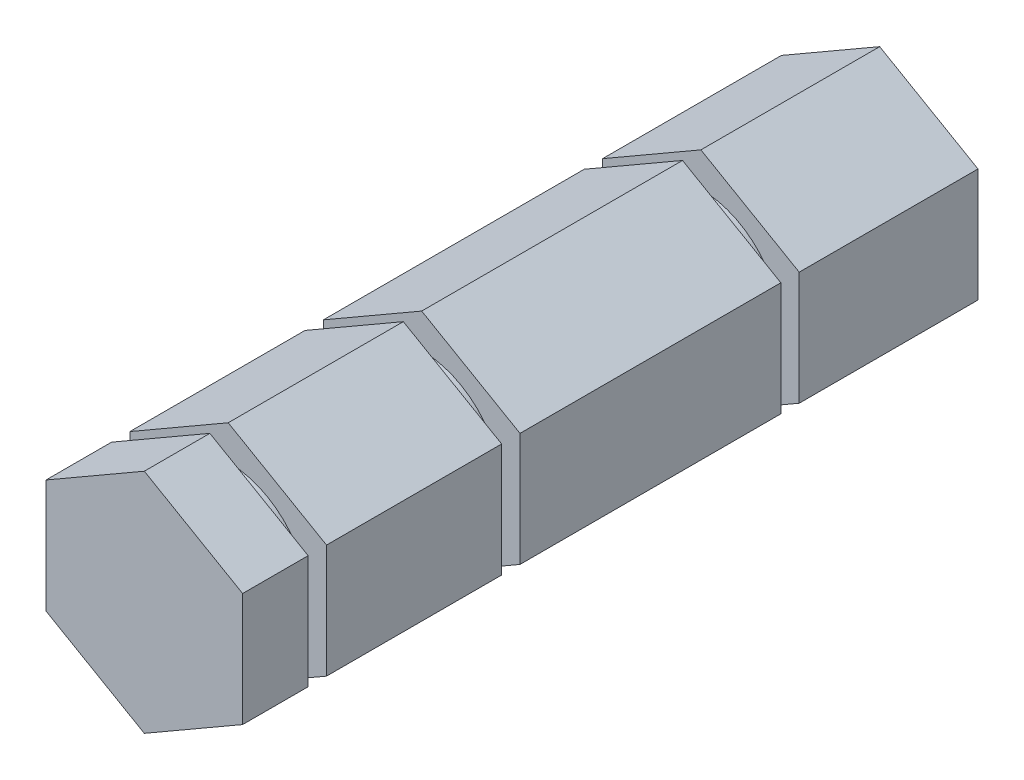
ISO-10303-21;
HEADER;
FILE_DESCRIPTION(('STEP AP214'),'2;1');
FILE_NAME('part.step','',(''),(''),'','','');
FILE_SCHEMA(('AUTOMOTIVE_DESIGN { 1 0 10303 214 1 1 1 1 }'));
ENDSEC;
DATA;
#1=APPLICATION_CONTEXT('core data for automotive mechanical design processes');
#2=APPLICATION_PROTOCOL_DEFINITION('international standard','automotive_design',2000,#1);
#3=PRODUCT_CONTEXT('',#1,'mechanical');
#4=PRODUCT('Part','Part','',(#3));
#5=PRODUCT_RELATED_PRODUCT_CATEGORY('part','',(#4));
#6=PRODUCT_DEFINITION_FORMATION('','',#4);
#7=PRODUCT_DEFINITION_CONTEXT('part definition',#1,'design');
#8=PRODUCT_DEFINITION('design','',#6,#7);
#9=PRODUCT_DEFINITION_SHAPE('','',#8);
#10=(LENGTH_UNIT() NAMED_UNIT(*) SI_UNIT(.MILLI.,.METRE.));
#11=(NAMED_UNIT(*) PLANE_ANGLE_UNIT() SI_UNIT($,.RADIAN.));
#12=(NAMED_UNIT(*) SI_UNIT($,.STERADIAN.) SOLID_ANGLE_UNIT());
#13=UNCERTAINTY_MEASURE_WITH_UNIT(LENGTH_MEASURE(1.E-05),#10,'distance_accuracy_value','');
#14=(GEOMETRIC_REPRESENTATION_CONTEXT(3) GLOBAL_UNCERTAINTY_ASSIGNED_CONTEXT((#13)) GLOBAL_UNIT_ASSIGNED_CONTEXT((#10,
#11,#12)) REPRESENTATION_CONTEXT('',''));
#15=CARTESIAN_POINT('',(0.,0.,0.));
#16=DIRECTION('',(0.,0.,1.));
#17=DIRECTION('',(1.,0.,0.));
#18=AXIS2_PLACEMENT_3D('',#15,#16,#17);
#19=CARTESIAN_POINT('',(4.76249999999996,2.74963065701564,40.6146));
#20=DIRECTION('',(-0.499999999999995,-0.866025403784441,0.));
#21=DIRECTION('',(0.866025403784442,-0.499999999999995,0.));
#22=AXIS2_PLACEMENT_3D('',#19,#20,#21);
#23=PLANE('',#22);
#24=DIRECTION('',(0.,0.,-1.));
#25=VECTOR('',#24,1.);
#26=CARTESIAN_POINT('',(0.,5.49926131403118,40.6146));
#27=LINE('',#26,#25);
#28=CARTESIAN_POINT('',(0.,5.49926131403118,31.5595));
#29=VERTEX_POINT('',#28);
#30=CARTESIAN_POINT('',(0.,5.49926131403118,23.0759));
#31=VERTEX_POINT('',#30);
#32=EDGE_CURVE('E211',#29,#31,#27,.T.);
#33=ORIENTED_EDGE('',*,*,#32,.F.);
#34=DIRECTION('',(0.866025403784442,-0.499999999999995,0.));
#35=VECTOR('',#34,1.);
#36=CARTESIAN_POINT('',(4.76249999999996,2.74963065701564,31.5595));
#37=LINE('',#36,#35);
#38=CARTESIAN_POINT('',(4.76249999999996,2.74963065701564,31.5595));
#39=VERTEX_POINT('',#38);
#40=EDGE_CURVE('E352',#29,#39,#37,.T.);
#41=ORIENTED_EDGE('',*,*,#40,.T.);
#42=DIRECTION('',(0.,0.,-1.));
#43=VECTOR('',#42,1.);
#44=CARTESIAN_POINT('',(4.76249999999996,2.74963065701564,40.6146));
#45=LINE('',#44,#43);
#46=CARTESIAN_POINT('',(4.76249999999996,2.74963065701564,23.0759));
#47=VERTEX_POINT('',#46);
#48=EDGE_CURVE('E248',#39,#47,#45,.T.);
#49=ORIENTED_EDGE('',*,*,#48,.T.);
#50=DIRECTION('',(-0.866025403784442,0.499999999999995,0.));
#51=VECTOR('',#50,1.);
#52=CARTESIAN_POINT('',(4.76249999999996,2.74963065701564,23.0759));
#53=LINE('',#52,#51);
#54=EDGE_CURVE('E261',#47,#31,#53,.T.);
#55=ORIENTED_EDGE('',*,*,#54,.T.);
#56=EDGE_LOOP('',(#33,#41,#49,#55));
#57=FACE_BOUND('',#56,.T.);
#58=ADVANCED_FACE('F34',(#57),#23,.F.);
#59=CARTESIAN_POINT('',(0.,5.49926131403118,40.6146));
#60=DIRECTION('',(0.500000000000001,-0.866025403784438,0.));
#61=DIRECTION('',(0.866025403784438,0.500000000000001,0.));
#62=AXIS2_PLACEMENT_3D('',#59,#60,#61);
#63=PLANE('',#62);
#64=DIRECTION('',(0.,0.,-1.));
#65=VECTOR('',#64,1.);
#66=CARTESIAN_POINT('',(-4.7625,2.74963065701558,40.6146));
#67=LINE('',#66,#65);
#68=CARTESIAN_POINT('',(-4.7625,2.74963065701558,31.5595));
#69=VERTEX_POINT('',#68);
#70=CARTESIAN_POINT('',(-4.7625,2.74963065701558,23.0759));
#71=VERTEX_POINT('',#70);
#72=EDGE_CURVE('E314',#69,#71,#67,.T.);
#73=ORIENTED_EDGE('',*,*,#72,.F.);
#74=DIRECTION('',(0.866025403784438,0.500000000000001,0.));
#75=VECTOR('',#74,1.);
#76=CARTESIAN_POINT('',(0.,5.49926131403118,31.5595));
#77=LINE('',#76,#75);
#78=EDGE_CURVE('E355',#69,#29,#77,.T.);
#79=ORIENTED_EDGE('',*,*,#78,.T.);
#80=ORIENTED_EDGE('',*,*,#32,.T.);
#81=DIRECTION('',(-0.866025403784438,-0.500000000000001,0.));
#82=VECTOR('',#81,1.);
#83=CARTESIAN_POINT('',(0.,5.49926131403118,23.0759));
#84=LINE('',#83,#82);
#85=EDGE_CURVE('E276',#31,#71,#84,.T.);
#86=ORIENTED_EDGE('',*,*,#85,.T.);
#87=EDGE_LOOP('',(#73,#79,#80,#86));
#88=FACE_BOUND('',#87,.T.);
#89=ADVANCED_FACE('F442',(#88),#63,.F.);
#90=CARTESIAN_POINT('',(-4.7625,2.74963065701558,40.6146));
#91=DIRECTION('',(1.,0.,0.));
#92=DIRECTION('',(0.,1.,0.));
#93=AXIS2_PLACEMENT_3D('',#90,#91,#92);
#94=PLANE('',#93);
#95=DIRECTION('',(0.,0.,-1.));
#96=VECTOR('',#95,1.);
#97=CARTESIAN_POINT('',(-4.76249999999998,-2.74963065701561,40.6146));
#98=LINE('',#97,#96);
#99=CARTESIAN_POINT('',(-4.76249999999998,-2.74963065701561,31.5595));
#100=VERTEX_POINT('',#99);
#101=CARTESIAN_POINT('',(-4.76249999999998,-2.74963065701561,23.0759));
#102=VERTEX_POINT('',#101);
#103=EDGE_CURVE('E312',#100,#102,#98,.T.);
#104=ORIENTED_EDGE('',*,*,#103,.F.);
#105=DIRECTION('',(0.,1.,0.));
#106=VECTOR('',#105,1.);
#107=CARTESIAN_POINT('',(-4.7625,2.74963065701558,31.5595));
#108=LINE('',#107,#106);
#109=EDGE_CURVE('E358',#100,#69,#108,.T.);
#110=ORIENTED_EDGE('',*,*,#109,.T.);
#111=ORIENTED_EDGE('',*,*,#72,.T.);
#112=DIRECTION('',(0.,-1.,0.));
#113=VECTOR('',#112,1.);
#114=CARTESIAN_POINT('',(-4.7625,2.74963065701558,23.0759));
#115=LINE('',#114,#113);
#116=EDGE_CURVE('E269',#71,#102,#115,.T.);
#117=ORIENTED_EDGE('',*,*,#116,.T.);
#118=EDGE_LOOP('',(#104,#110,#111,#117));
#119=FACE_BOUND('',#118,.T.);
#120=ADVANCED_FACE('F448',(#119),#94,.F.);
#121=CARTESIAN_POINT('',(-4.76249999999998,-2.74963065701561,40.6146));
#122=DIRECTION('',(0.499999999999995,0.866025403784441,0.));
#123=DIRECTION('',(-0.866025403784442,0.499999999999995,0.));
#124=AXIS2_PLACEMENT_3D('',#121,#122,#123);
#125=PLANE('',#124);
#126=DIRECTION('',(0.,0.,-1.));
#127=VECTOR('',#126,1.);
#128=CARTESIAN_POINT('',(0.,-5.49926131403118,40.6146));
#129=LINE('',#128,#127);
#130=CARTESIAN_POINT('',(0.,-5.49926131403118,31.5595));
#131=VERTEX_POINT('',#130);
#132=CARTESIAN_POINT('',(0.,-5.49926131403118,23.0759));
#133=VERTEX_POINT('',#132);
#134=EDGE_CURVE('E266',#131,#133,#129,.T.);
#135=ORIENTED_EDGE('',*,*,#134,.F.);
#136=DIRECTION('',(-0.866025403784442,0.499999999999995,0.));
#137=VECTOR('',#136,1.);
#138=CARTESIAN_POINT('',(-4.76249999999998,-2.74963065701561,31.5595));
#139=LINE('',#138,#137);
#140=EDGE_CURVE('E361',#131,#100,#139,.T.);
#141=ORIENTED_EDGE('',*,*,#140,.T.);
#142=ORIENTED_EDGE('',*,*,#103,.T.);
#143=DIRECTION('',(0.866025403784442,-0.499999999999995,0.));
#144=VECTOR('',#143,1.);
#145=CARTESIAN_POINT('',(-4.76249999999998,-2.74963065701561,23.0759));
#146=LINE('',#145,#144);
#147=EDGE_CURVE('E267',#102,#133,#146,.T.);
#148=ORIENTED_EDGE('',*,*,#147,.T.);
#149=EDGE_LOOP('',(#135,#141,#142,#148));
#150=FACE_BOUND('',#149,.T.);
#151=ADVANCED_FACE('F519',(#150),#125,.F.);
#152=CARTESIAN_POINT('',(0.,-5.49926131403118,40.6146));
#153=DIRECTION('',(-0.500000000000007,0.866025403784434,0.));
#154=DIRECTION('',(-0.866025403784435,-0.500000000000007,0.));
#155=AXIS2_PLACEMENT_3D('',#152,#153,#154);
#156=PLANE('',#155);
#157=DIRECTION('',(0.,0.,-1.));
#158=VECTOR('',#157,1.);
#159=CARTESIAN_POINT('',(4.76250000000002,-2.74963065701554,40.6146));
#160=LINE('',#159,#158);
#161=CARTESIAN_POINT('',(4.76250000000002,-2.74963065701554,31.5595));
#162=VERTEX_POINT('',#161);
#163=CARTESIAN_POINT('',(4.76250000000002,-2.74963065701554,23.0759));
#164=VERTEX_POINT('',#163);
#165=EDGE_CURVE('E250',#162,#164,#160,.T.);
#166=ORIENTED_EDGE('',*,*,#165,.F.);
#167=DIRECTION('',(-0.866025403784435,-0.500000000000007,0.));
#168=VECTOR('',#167,1.);
#169=CARTESIAN_POINT('',(0.,-5.49926131403118,31.5595));
#170=LINE('',#169,#168);
#171=EDGE_CURVE('E364',#162,#131,#170,.T.);
#172=ORIENTED_EDGE('',*,*,#171,.T.);
#173=ORIENTED_EDGE('',*,*,#134,.T.);
#174=DIRECTION('',(0.866025403784435,0.500000000000007,0.));
#175=VECTOR('',#174,1.);
#176=CARTESIAN_POINT('',(0.,-5.49926131403118,23.0759));
#177=LINE('',#176,#175);
#178=EDGE_CURVE('E257',#133,#164,#177,.T.);
#179=ORIENTED_EDGE('',*,*,#178,.T.);
#180=EDGE_LOOP('',(#166,#172,#173,#179));
#181=FACE_BOUND('',#180,.T.);
#182=ADVANCED_FACE('F263',(#181),#156,.F.);
#183=CARTESIAN_POINT('',(4.76250000000002,-2.74963065701554,40.6146));
#184=DIRECTION('',(-1.,0.,0.));
#185=DIRECTION('',(0.,-1.,0.));
#186=AXIS2_PLACEMENT_3D('',#183,#184,#185);
#187=PLANE('',#186);
#188=ORIENTED_EDGE('',*,*,#48,.F.);
#189=DIRECTION('',(0.,-1.,0.));
#190=VECTOR('',#189,1.);
#191=CARTESIAN_POINT('',(4.76250000000002,-2.74963065701554,31.5595));
#192=LINE('',#191,#190);
#193=EDGE_CURVE('E238',#39,#162,#192,.T.);
#194=ORIENTED_EDGE('',*,*,#193,.T.);
#195=ORIENTED_EDGE('',*,*,#165,.T.);
#196=DIRECTION('',(0.,1.,0.));
#197=VECTOR('',#196,1.);
#198=CARTESIAN_POINT('',(4.76250000000002,-2.74963065701554,23.0759));
#199=LINE('',#198,#197);
#200=EDGE_CURVE('E215',#164,#47,#199,.T.);
#201=ORIENTED_EDGE('',*,*,#200,.T.);
#202=EDGE_LOOP('',(#188,#194,#195,#201));
#203=FACE_BOUND('',#202,.T.);
#204=ADVANCED_FACE('F247',(#203),#187,.F.);
#205=CARTESIAN_POINT('',(0.,0.,23.0759));
#206=DIRECTION('',(0.,0.,1.));
#207=DIRECTION('',(1.,0.,0.));
#208=AXIS2_PLACEMENT_3D('',#205,#206,#207);
#209=PLANE('',#208);
#210=CARTESIAN_POINT('',(0.,0.,23.0759));
#211=DIRECTION('',(0.,0.,-1.));
#212=DIRECTION('',(-1.,0.,0.));
#213=AXIS2_PLACEMENT_3D('',#210,#211,#212);
#214=CIRCLE('',#213,3.8481);
#215=CARTESIAN_POINT('',(-3.8481,0.,23.0759));
#216=VERTEX_POINT('',#215);
#217=EDGE_CURVE('E335',#216,#216,#214,.T.);
#218=ORIENTED_EDGE('',*,*,#217,.F.);
#219=EDGE_LOOP('',(#218));
#220=FACE_BOUND('',#219,.T.);
#221=ORIENTED_EDGE('',*,*,#200,.F.);
#222=ORIENTED_EDGE('',*,*,#178,.F.);
#223=ORIENTED_EDGE('',*,*,#147,.F.);
#224=ORIENTED_EDGE('',*,*,#116,.F.);
#225=ORIENTED_EDGE('',*,*,#85,.F.);
#226=ORIENTED_EDGE('',*,*,#54,.F.);
#227=EDGE_LOOP('',(#221,#222,#223,#224,#225,#226));
#228=FACE_BOUND('',#227,.T.);
#229=ADVANCED_FACE('F255',(#220,#228),#209,.F.);
#230=CARTESIAN_POINT('',(0.,0.,22.1869));
#231=DIRECTION('',(0.,0.,1.));
#232=DIRECTION('',(1.,0.,0.));
#233=AXIS2_PLACEMENT_3D('',#230,#231,#232);
#234=PLANE('',#233);
#235=CARTESIAN_POINT('',(0.,0.,22.1869));
#236=DIRECTION('',(0.,0.,-1.));
#237=DIRECTION('',(-1.,0.,0.));
#238=AXIS2_PLACEMENT_3D('',#235,#236,#237);
#239=CIRCLE('',#238,3.8481);
#240=CARTESIAN_POINT('',(-3.8481,0.,22.1869));
#241=VERTEX_POINT('',#240);
#242=EDGE_CURVE('E336',#241,#241,#239,.T.);
#243=ORIENTED_EDGE('',*,*,#242,.T.);
#244=EDGE_LOOP('',(#243));
#245=FACE_BOUND('',#244,.T.);
#246=DIRECTION('',(-0.866025403784442,0.499999999999995,0.));
#247=VECTOR('',#246,1.);
#248=CARTESIAN_POINT('',(4.76249999999996,2.74963065701564,22.1869));
#249=LINE('',#248,#247);
#250=CARTESIAN_POINT('',(4.76249999999996,2.74963065701564,22.1869));
#251=VERTEX_POINT('',#250);
#252=CARTESIAN_POINT('',(0.,5.49926131403118,22.1869));
#253=VERTEX_POINT('',#252);
#254=EDGE_CURVE('E230',#251,#253,#249,.T.);
#255=ORIENTED_EDGE('',*,*,#254,.T.);
#256=DIRECTION('',(-0.866025403784438,-0.500000000000001,0.));
#257=VECTOR('',#256,1.);
#258=CARTESIAN_POINT('',(0.,5.49926131403118,22.1869));
#259=LINE('',#258,#257);
#260=CARTESIAN_POINT('',(-4.7625,2.74963065701558,22.1869));
#261=VERTEX_POINT('',#260);
#262=EDGE_CURVE('E225',#253,#261,#259,.T.);
#263=ORIENTED_EDGE('',*,*,#262,.T.);
#264=DIRECTION('',(0.,-1.,0.));
#265=VECTOR('',#264,1.);
#266=CARTESIAN_POINT('',(-4.7625,2.74963065701558,22.1869));
#267=LINE('',#266,#265);
#268=CARTESIAN_POINT('',(-4.76249999999998,-2.74963065701561,22.1869));
#269=VERTEX_POINT('',#268);
#270=EDGE_CURVE('E326',#261,#269,#267,.T.);
#271=ORIENTED_EDGE('',*,*,#270,.T.);
#272=DIRECTION('',(0.866025403784442,-0.499999999999995,0.));
#273=VECTOR('',#272,1.);
#274=CARTESIAN_POINT('',(-4.76249999999998,-2.74963065701561,22.1869));
#275=LINE('',#274,#273);
#276=CARTESIAN_POINT('',(0.,-5.49926131403118,22.1869));
#277=VERTEX_POINT('',#276);
#278=EDGE_CURVE('E329',#269,#277,#275,.T.);
#279=ORIENTED_EDGE('',*,*,#278,.T.);
#280=DIRECTION('',(0.866025403784435,0.500000000000007,0.));
#281=VECTOR('',#280,1.);
#282=CARTESIAN_POINT('',(0.,-5.49926131403118,22.1869));
#283=LINE('',#282,#281);
#284=CARTESIAN_POINT('',(4.76250000000002,-2.74963065701554,22.1869));
#285=VERTEX_POINT('',#284);
#286=EDGE_CURVE('E331',#277,#285,#283,.T.);
#287=ORIENTED_EDGE('',*,*,#286,.T.);
#288=DIRECTION('',(0.,1.,0.));
#289=VECTOR('',#288,1.);
#290=CARTESIAN_POINT('',(4.76250000000002,-2.74963065701554,22.1869));
#291=LINE('',#290,#289);
#292=EDGE_CURVE('E210',#285,#251,#291,.T.);
#293=ORIENTED_EDGE('',*,*,#292,.T.);
#294=EDGE_LOOP('',(#255,#263,#271,#279,#287,#293));
#295=FACE_BOUND('',#294,.T.);
#296=ADVANCED_FACE('F590',(#245,#295),#234,.T.);
#297=CARTESIAN_POINT('',(0.,0.,23.0759));
#298=DIRECTION('',(0.,0.,-1.));
#299=DIRECTION('',(-1.,0.,0.));
#300=AXIS2_PLACEMENT_3D('',#297,#298,#299);
#301=CYLINDRICAL_SURFACE('',#300,3.8481);
#302=ORIENTED_EDGE('',*,*,#217,.T.);
#303=EDGE_LOOP('',(#302));
#304=FACE_BOUND('',#303,.T.);
#305=ORIENTED_EDGE('',*,*,#242,.F.);
#306=EDGE_LOOP('',(#305));
#307=FACE_BOUND('',#306,.T.);
#308=ADVANCED_FACE('F437',(#304,#307),#301,.T.);
#309=CARTESIAN_POINT('',(4.76250000000002,-2.74963065701554,9.5504));
#310=VERTEX_POINT('',#309);
#311=EDGE_CURVE('E305',#285,#310,#160,.T.);
#312=ORIENTED_EDGE('',*,*,#311,.T.);
#313=DIRECTION('',(0.,1.,0.));
#314=VECTOR('',#313,1.);
#315=CARTESIAN_POINT('',(4.76250000000002,-2.74963065701554,9.5504));
#316=LINE('',#315,#314);
#317=CARTESIAN_POINT('',(4.76249999999996,2.74963065701564,9.5504));
#318=VERTEX_POINT('',#317);
#319=EDGE_CURVE('E382',#310,#318,#316,.T.);
#320=ORIENTED_EDGE('',*,*,#319,.T.);
#321=EDGE_CURVE('E233',#251,#318,#45,.T.);
#322=ORIENTED_EDGE('',*,*,#321,.F.);
#323=ORIENTED_EDGE('',*,*,#292,.F.);
#324=EDGE_LOOP('',(#312,#320,#322,#323));
#325=FACE_BOUND('',#324,.T.);
#326=ADVANCED_FACE('F423',(#325),#187,.F.);
#327=CARTESIAN_POINT('',(0.,-5.49926131403118,9.5504));
#328=VERTEX_POINT('',#327);
#329=EDGE_CURVE('E309',#277,#328,#129,.T.);
#330=ORIENTED_EDGE('',*,*,#329,.T.);
#331=DIRECTION('',(0.866025403784435,0.500000000000007,0.));
#332=VECTOR('',#331,1.);
#333=CARTESIAN_POINT('',(0.,-5.49926131403118,9.5504));
#334=LINE('',#333,#332);
#335=EDGE_CURVE('E384',#328,#310,#334,.T.);
#336=ORIENTED_EDGE('',*,*,#335,.T.);
#337=ORIENTED_EDGE('',*,*,#311,.F.);
#338=ORIENTED_EDGE('',*,*,#286,.F.);
#339=EDGE_LOOP('',(#330,#336,#337,#338));
#340=FACE_BOUND('',#339,.T.);
#341=ADVANCED_FACE('F430',(#340),#156,.F.);
#342=CARTESIAN_POINT('',(-4.76249999999998,-2.74963065701561,9.5504));
#343=VERTEX_POINT('',#342);
#344=EDGE_CURVE('E313',#269,#343,#98,.T.);
#345=ORIENTED_EDGE('',*,*,#344,.T.);
#346=DIRECTION('',(0.866025403784442,-0.499999999999995,0.));
#347=VECTOR('',#346,1.);
#348=CARTESIAN_POINT('',(-4.76249999999998,-2.74963065701561,9.5504));
#349=LINE('',#348,#347);
#350=EDGE_CURVE('E387',#343,#328,#349,.T.);
#351=ORIENTED_EDGE('',*,*,#350,.T.);
#352=ORIENTED_EDGE('',*,*,#329,.F.);
#353=ORIENTED_EDGE('',*,*,#278,.F.);
#354=EDGE_LOOP('',(#345,#351,#352,#353));
#355=FACE_BOUND('',#354,.T.);
#356=ADVANCED_FACE('F510',(#355),#125,.F.);
#357=CARTESIAN_POINT('',(-4.7625,2.74963065701558,9.5504));
#358=VERTEX_POINT('',#357);
#359=EDGE_CURVE('E315',#261,#358,#67,.T.);
#360=ORIENTED_EDGE('',*,*,#359,.T.);
#361=DIRECTION('',(0.,-1.,0.));
#362=VECTOR('',#361,1.);
#363=CARTESIAN_POINT('',(-4.7625,2.74963065701558,9.5504));
#364=LINE('',#363,#362);
#365=EDGE_CURVE('E324',#358,#343,#364,.T.);
#366=ORIENTED_EDGE('',*,*,#365,.T.);
#367=ORIENTED_EDGE('',*,*,#344,.F.);
#368=ORIENTED_EDGE('',*,*,#270,.F.);
#369=EDGE_LOOP('',(#360,#366,#367,#368));
#370=FACE_BOUND('',#369,.T.);
#371=ADVANCED_FACE('F322',(#370),#94,.F.);
#372=CARTESIAN_POINT('',(0.,5.49926131403118,9.5504));
#373=VERTEX_POINT('',#372);
#374=EDGE_CURVE('E214',#253,#373,#27,.T.);
#375=ORIENTED_EDGE('',*,*,#374,.T.);
#376=DIRECTION('',(-0.866025403784438,-0.500000000000001,0.));
#377=VECTOR('',#376,1.);
#378=CARTESIAN_POINT('',(0.,5.49926131403118,9.5504));
#379=LINE('',#378,#377);
#380=EDGE_CURVE('E55',#373,#358,#379,.T.);
#381=ORIENTED_EDGE('',*,*,#380,.T.);
#382=ORIENTED_EDGE('',*,*,#359,.F.);
#383=ORIENTED_EDGE('',*,*,#262,.F.);
#384=EDGE_LOOP('',(#375,#381,#382,#383));
#385=FACE_BOUND('',#384,.T.);
#386=ADVANCED_FACE('F222',(#385),#63,.F.);
#387=ORIENTED_EDGE('',*,*,#321,.T.);
#388=DIRECTION('',(-0.866025403784442,0.499999999999995,0.));
#389=VECTOR('',#388,1.);
#390=CARTESIAN_POINT('',(4.76249999999996,2.74963065701564,9.5504));
#391=LINE('',#390,#389);
#392=EDGE_CURVE('E232',#318,#373,#391,.T.);
#393=ORIENTED_EDGE('',*,*,#392,.T.);
#394=ORIENTED_EDGE('',*,*,#374,.F.);
#395=ORIENTED_EDGE('',*,*,#254,.F.);
#396=EDGE_LOOP('',(#387,#393,#394,#395));
#397=FACE_BOUND('',#396,.T.);
#398=ADVANCED_FACE('F229',(#397),#23,.F.);
#399=CARTESIAN_POINT('',(0.,0.,32.4485));
#400=DIRECTION('',(0.,0.,-1.));
#401=DIRECTION('',(-1.,0.,0.));
#402=AXIS2_PLACEMENT_3D('',#399,#400,#401);
#403=PLANE('',#402);
#404=CARTESIAN_POINT('',(0.,0.,32.4485));
#405=DIRECTION('',(0.,0.,-1.));
#406=DIRECTION('',(-1.,0.,0.));
#407=AXIS2_PLACEMENT_3D('',#404,#405,#406);
#408=CIRCLE('',#407,3.8481);
#409=CARTESIAN_POINT('',(-3.8481,0.,32.4485));
#410=VERTEX_POINT('',#409);
#411=EDGE_CURVE('E366',#410,#410,#408,.T.);
#412=ORIENTED_EDGE('',*,*,#411,.F.);
#413=EDGE_LOOP('',(#412));
#414=FACE_BOUND('',#413,.T.);
#415=DIRECTION('',(0.866025403784442,-0.499999999999995,0.));
#416=VECTOR('',#415,1.);
#417=CARTESIAN_POINT('',(4.76249999999996,2.74963065701564,32.4485));
#418=LINE('',#417,#416);
#419=CARTESIAN_POINT('',(0.,5.49926131403118,32.4485));
#420=VERTEX_POINT('',#419);
#421=CARTESIAN_POINT('',(4.76249999999996,2.74963065701564,32.4485));
#422=VERTEX_POINT('',#421);
#423=EDGE_CURVE('E209',#420,#422,#418,.T.);
#424=ORIENTED_EDGE('',*,*,#423,.T.);
#425=DIRECTION('',(0.,-1.,0.));
#426=VECTOR('',#425,1.);
#427=CARTESIAN_POINT('',(4.76250000000002,-2.74963065701554,32.4485));
#428=LINE('',#427,#426);
#429=CARTESIAN_POINT('',(4.76250000000002,-2.74963065701554,32.4485));
#430=VERTEX_POINT('',#429);
#431=EDGE_CURVE('E235',#422,#430,#428,.T.);
#432=ORIENTED_EDGE('',*,*,#431,.T.);
#433=DIRECTION('',(-0.866025403784435,-0.500000000000007,0.));
#434=VECTOR('',#433,1.);
#435=CARTESIAN_POINT('',(0.,-5.49926131403118,32.4485));
#436=LINE('',#435,#434);
#437=CARTESIAN_POINT('',(0.,-5.49926131403118,32.4485));
#438=VERTEX_POINT('',#437);
#439=EDGE_CURVE('E349',#430,#438,#436,.T.);
#440=ORIENTED_EDGE('',*,*,#439,.T.);
#441=DIRECTION('',(-0.866025403784442,0.499999999999995,0.));
#442=VECTOR('',#441,1.);
#443=CARTESIAN_POINT('',(-4.76249999999998,-2.74963065701561,32.4485));
#444=LINE('',#443,#442);
#445=CARTESIAN_POINT('',(-4.76249999999998,-2.74963065701561,32.4485));
#446=VERTEX_POINT('',#445);
#447=EDGE_CURVE('E346',#438,#446,#444,.T.);
#448=ORIENTED_EDGE('',*,*,#447,.T.);
#449=DIRECTION('',(0.,1.,0.));
#450=VECTOR('',#449,1.);
#451=CARTESIAN_POINT('',(-4.7625,2.74963065701558,32.4485));
#452=LINE('',#451,#450);
#453=CARTESIAN_POINT('',(-4.7625,2.74963065701558,32.4485));
#454=VERTEX_POINT('',#453);
#455=EDGE_CURVE('E344',#446,#454,#452,.T.);
#456=ORIENTED_EDGE('',*,*,#455,.T.);
#457=DIRECTION('',(0.866025403784438,0.500000000000001,0.));
#458=VECTOR('',#457,1.);
#459=CARTESIAN_POINT('',(0.,5.49926131403118,32.4485));
#460=LINE('',#459,#458);
#461=EDGE_CURVE('E342',#454,#420,#460,.T.);
#462=ORIENTED_EDGE('',*,*,#461,.T.);
#463=EDGE_LOOP('',(#424,#432,#440,#448,#456,#462));
#464=FACE_BOUND('',#463,.T.);
#465=ADVANCED_FACE('F416',(#414,#464),#403,.T.);
#466=CARTESIAN_POINT('',(0.,0.,31.5595));
#467=DIRECTION('',(0.,0.,-1.));
#468=DIRECTION('',(-1.,0.,0.));
#469=AXIS2_PLACEMENT_3D('',#466,#467,#468);
#470=PLANE('',#469);
#471=CARTESIAN_POINT('',(0.,0.,31.5595));
#472=DIRECTION('',(0.,0.,-1.));
#473=DIRECTION('',(-1.,0.,0.));
#474=AXIS2_PLACEMENT_3D('',#471,#472,#473);
#475=CIRCLE('',#474,3.8481);
#476=CARTESIAN_POINT('',(-3.8481,0.,31.5595));
#477=VERTEX_POINT('',#476);
#478=EDGE_CURVE('E367',#477,#477,#475,.T.);
#479=ORIENTED_EDGE('',*,*,#478,.T.);
#480=EDGE_LOOP('',(#479));
#481=FACE_BOUND('',#480,.T.);
#482=ORIENTED_EDGE('',*,*,#78,.F.);
#483=ORIENTED_EDGE('',*,*,#109,.F.);
#484=ORIENTED_EDGE('',*,*,#140,.F.);
#485=ORIENTED_EDGE('',*,*,#171,.F.);
#486=ORIENTED_EDGE('',*,*,#193,.F.);
#487=ORIENTED_EDGE('',*,*,#40,.F.);
#488=EDGE_LOOP('',(#482,#483,#484,#485,#486,#487));
#489=FACE_BOUND('',#488,.T.);
#490=ADVANCED_FACE('F432',(#481,#489),#470,.F.);
#491=CARTESIAN_POINT('',(0.,0.,32.4485));
#492=DIRECTION('',(0.,0.,-1.));
#493=DIRECTION('',(-1.,0.,0.));
#494=AXIS2_PLACEMENT_3D('',#491,#492,#493);
#495=CYLINDRICAL_SURFACE('',#494,3.8481);
#496=ORIENTED_EDGE('',*,*,#411,.T.);
#497=EDGE_LOOP('',(#496));
#498=FACE_BOUND('',#497,.T.);
#499=ORIENTED_EDGE('',*,*,#478,.F.);
#500=EDGE_LOOP('',(#499));
#501=FACE_BOUND('',#500,.T.);
#502=ADVANCED_FACE('F421',(#498,#501),#495,.T.);
#503=CARTESIAN_POINT('',(4.76249999999996,2.74963065701564,35.6235));
#504=VERTEX_POINT('',#503);
#505=EDGE_CURVE('E299',#504,#422,#45,.T.);
#506=ORIENTED_EDGE('',*,*,#505,.F.);
#507=DIRECTION('',(0.,-1.,0.));
#508=VECTOR('',#507,1.);
#509=CARTESIAN_POINT('',(4.76250000000002,-2.74963065701554,35.6235));
#510=LINE('',#509,#508);
#511=CARTESIAN_POINT('',(4.76250000000002,-2.74963065701554,35.6235));
#512=VERTEX_POINT('',#511);
#513=EDGE_CURVE('E48',#504,#512,#510,.T.);
#514=ORIENTED_EDGE('',*,*,#513,.T.);
#515=EDGE_CURVE('E302',#512,#430,#160,.T.);
#516=ORIENTED_EDGE('',*,*,#515,.T.);
#517=ORIENTED_EDGE('',*,*,#431,.F.);
#518=EDGE_LOOP('',(#506,#514,#516,#517));
#519=FACE_BOUND('',#518,.T.);
#520=ADVANCED_FACE('F419',(#519),#187,.F.);
#521=ORIENTED_EDGE('',*,*,#515,.F.);
#522=DIRECTION('',(-0.866025403784435,-0.500000000000007,0.));
#523=VECTOR('',#522,1.);
#524=CARTESIAN_POINT('',(0.,-5.49926131403118,35.6235));
#525=LINE('',#524,#523);
#526=CARTESIAN_POINT('',(0.,-5.49926131403118,35.6235));
#527=VERTEX_POINT('',#526);
#528=EDGE_CURVE('E399',#512,#527,#525,.T.);
#529=ORIENTED_EDGE('',*,*,#528,.T.);
#530=EDGE_CURVE('E306',#527,#438,#129,.T.);
#531=ORIENTED_EDGE('',*,*,#530,.T.);
#532=ORIENTED_EDGE('',*,*,#439,.F.);
#533=EDGE_LOOP('',(#521,#529,#531,#532));
#534=FACE_BOUND('',#533,.T.);
#535=ADVANCED_FACE('F414',(#534),#156,.F.);
#536=ORIENTED_EDGE('',*,*,#530,.F.);
#537=DIRECTION('',(-0.866025403784442,0.499999999999995,0.));
#538=VECTOR('',#537,1.);
#539=CARTESIAN_POINT('',(-4.76249999999998,-2.74963065701561,35.6235));
#540=LINE('',#539,#538);
#541=CARTESIAN_POINT('',(-4.76249999999998,-2.74963065701561,35.6235));
#542=VERTEX_POINT('',#541);
#543=EDGE_CURVE('E402',#527,#542,#540,.T.);
#544=ORIENTED_EDGE('',*,*,#543,.T.);
#545=EDGE_CURVE('E310',#542,#446,#98,.T.);
#546=ORIENTED_EDGE('',*,*,#545,.T.);
#547=ORIENTED_EDGE('',*,*,#447,.F.);
#548=EDGE_LOOP('',(#536,#544,#546,#547));
#549=FACE_BOUND('',#548,.T.);
#550=ADVANCED_FACE('F409',(#549),#125,.F.);
#551=ORIENTED_EDGE('',*,*,#545,.F.);
#552=DIRECTION('',(0.,1.,0.));
#553=VECTOR('',#552,1.);
#554=CARTESIAN_POINT('',(-4.7625,2.74963065701558,35.6235));
#555=LINE('',#554,#553);
#556=CARTESIAN_POINT('',(-4.7625,2.74963065701558,35.6235));
#557=VERTEX_POINT('',#556);
#558=EDGE_CURVE('E204',#542,#557,#555,.T.);
#559=ORIENTED_EDGE('',*,*,#558,.T.);
#560=EDGE_CURVE('E203',#557,#454,#67,.T.);
#561=ORIENTED_EDGE('',*,*,#560,.T.);
#562=ORIENTED_EDGE('',*,*,#455,.F.);
#563=EDGE_LOOP('',(#551,#559,#561,#562));
#564=FACE_BOUND('',#563,.T.);
#565=ADVANCED_FACE('F406',(#564),#94,.F.);
#566=ORIENTED_EDGE('',*,*,#560,.F.);
#567=DIRECTION('',(0.866025403784438,0.500000000000001,0.));
#568=VECTOR('',#567,1.);
#569=CARTESIAN_POINT('',(0.,5.49926131403118,35.6235));
#570=LINE('',#569,#568);
#571=CARTESIAN_POINT('',(0.,5.49926131403118,35.6235));
#572=VERTEX_POINT('',#571);
#573=EDGE_CURVE('E192',#557,#572,#570,.T.);
#574=ORIENTED_EDGE('',*,*,#573,.T.);
#575=EDGE_CURVE('E201',#572,#420,#27,.T.);
#576=ORIENTED_EDGE('',*,*,#575,.T.);
#577=ORIENTED_EDGE('',*,*,#461,.F.);
#578=EDGE_LOOP('',(#566,#574,#576,#577));
#579=FACE_BOUND('',#578,.T.);
#580=ADVANCED_FACE('F199',(#579),#63,.F.);
#581=ORIENTED_EDGE('',*,*,#575,.F.);
#582=DIRECTION('',(0.866025403784442,-0.499999999999995,0.));
#583=VECTOR('',#582,1.);
#584=CARTESIAN_POINT('',(4.76249999999996,2.74963065701564,35.6235));
#585=LINE('',#584,#583);
#586=EDGE_CURVE('E12',#572,#504,#585,.T.);
#587=ORIENTED_EDGE('',*,*,#586,.T.);
#588=ORIENTED_EDGE('',*,*,#505,.T.);
#589=ORIENTED_EDGE('',*,*,#423,.F.);
#590=EDGE_LOOP('',(#581,#587,#588,#589));
#591=FACE_BOUND('',#590,.T.);
#592=ADVANCED_FACE('F207',(#591),#23,.F.);
#593=CARTESIAN_POINT('',(0.,0.,8.6614));
#594=DIRECTION('',(0.,0.,1.));
#595=DIRECTION('',(1.,0.,0.));
#596=AXIS2_PLACEMENT_3D('',#593,#594,#595);
#597=PLANE('',#596);
#598=CARTESIAN_POINT('',(0.,0.,8.6614));
#599=DIRECTION('',(0.,0.,1.));
#600=DIRECTION('',(1.,0.,0.));
#601=AXIS2_PLACEMENT_3D('',#598,#599,#600);
#602=CIRCLE('',#601,3.8481);
#603=CARTESIAN_POINT('',(3.8481,0.,8.6614));
#604=VERTEX_POINT('',#603);
#605=EDGE_CURVE('E392',#604,#604,#602,.T.);
#606=ORIENTED_EDGE('',*,*,#605,.F.);
#607=EDGE_LOOP('',(#606));
#608=FACE_BOUND('',#607,.T.);
#609=DIRECTION('',(0.,1.,0.));
#610=VECTOR('',#609,1.);
#611=CARTESIAN_POINT('',(4.76250000000002,-2.74963065701554,8.6614));
#612=LINE('',#611,#610);
#613=CARTESIAN_POINT('',(4.76250000000002,-2.74963065701554,8.6614));
#614=VERTEX_POINT('',#613);
#615=CARTESIAN_POINT('',(4.76249999999996,2.74963065701564,8.6614));
#616=VERTEX_POINT('',#615);
#617=EDGE_CURVE('E370',#614,#616,#612,.T.);
#618=ORIENTED_EDGE('',*,*,#617,.T.);
#619=DIRECTION('',(-0.866025403784442,0.499999999999995,0.));
#620=VECTOR('',#619,1.);
#621=CARTESIAN_POINT('',(4.76249999999996,2.74963065701564,8.6614));
#622=LINE('',#621,#620);
#623=CARTESIAN_POINT('',(0.,5.49926131403118,8.6614));
#624=VERTEX_POINT('',#623);
#625=EDGE_CURVE('E41',#616,#624,#622,.T.);
#626=ORIENTED_EDGE('',*,*,#625,.T.);
#627=DIRECTION('',(-0.866025403784438,-0.500000000000001,0.));
#628=VECTOR('',#627,1.);
#629=CARTESIAN_POINT('',(0.,5.49926131403118,8.6614));
#630=LINE('',#629,#628);
#631=CARTESIAN_POINT('',(-4.7625,2.74963065701558,8.6614));
#632=VERTEX_POINT('',#631);
#633=EDGE_CURVE('E380',#624,#632,#630,.T.);
#634=ORIENTED_EDGE('',*,*,#633,.T.);
#635=DIRECTION('',(0.,-1.,0.));
#636=VECTOR('',#635,1.);
#637=CARTESIAN_POINT('',(-4.7625,2.74963065701558,8.6614));
#638=LINE('',#637,#636);
#639=CARTESIAN_POINT('',(-4.76249999999998,-2.74963065701561,8.6614));
#640=VERTEX_POINT('',#639);
#641=EDGE_CURVE('E378',#632,#640,#638,.T.);
#642=ORIENTED_EDGE('',*,*,#641,.T.);
#643=DIRECTION('',(0.866025403784442,-0.499999999999995,0.));
#644=VECTOR('',#643,1.);
#645=CARTESIAN_POINT('',(-4.76249999999998,-2.74963065701561,8.6614));
#646=LINE('',#645,#644);
#647=CARTESIAN_POINT('',(0.,-5.49926131403118,8.6614));
#648=VERTEX_POINT('',#647);
#649=EDGE_CURVE('E376',#640,#648,#646,.T.);
#650=ORIENTED_EDGE('',*,*,#649,.T.);
#651=DIRECTION('',(0.866025403784435,0.500000000000007,0.));
#652=VECTOR('',#651,1.);
#653=CARTESIAN_POINT('',(0.,-5.49926131403118,8.6614));
#654=LINE('',#653,#652);
#655=EDGE_CURVE('E374',#648,#614,#654,.T.);
#656=ORIENTED_EDGE('',*,*,#655,.T.);
#657=EDGE_LOOP('',(#618,#626,#634,#642,#650,#656));
#658=FACE_BOUND('',#657,.T.);
#659=ADVANCED_FACE('F463',(#608,#658),#597,.T.);
#660=CARTESIAN_POINT('',(0.,0.,9.5504));
#661=DIRECTION('',(0.,0.,1.));
#662=DIRECTION('',(1.,0.,0.));
#663=AXIS2_PLACEMENT_3D('',#660,#661,#662);
#664=PLANE('',#663);
#665=CARTESIAN_POINT('',(0.,0.,9.5504));
#666=DIRECTION('',(0.,0.,1.));
#667=DIRECTION('',(1.,0.,0.));
#668=AXIS2_PLACEMENT_3D('',#665,#666,#667);
#669=CIRCLE('',#668,3.8481);
#670=CARTESIAN_POINT('',(3.8481,0.,9.5504));
#671=VERTEX_POINT('',#670);
#672=EDGE_CURVE('E393',#671,#671,#669,.T.);
#673=ORIENTED_EDGE('',*,*,#672,.T.);
#674=EDGE_LOOP('',(#673));
#675=FACE_BOUND('',#674,.T.);
#676=ORIENTED_EDGE('',*,*,#335,.F.);
#677=ORIENTED_EDGE('',*,*,#350,.F.);
#678=ORIENTED_EDGE('',*,*,#365,.F.);
#679=ORIENTED_EDGE('',*,*,#380,.F.);
#680=ORIENTED_EDGE('',*,*,#392,.F.);
#681=ORIENTED_EDGE('',*,*,#319,.F.);
#682=EDGE_LOOP('',(#676,#677,#678,#679,#680,#681));
#683=FACE_BOUND('',#682,.T.);
#684=ADVANCED_FACE('F468',(#675,#683),#664,.F.);
#685=CARTESIAN_POINT('',(0.,0.,8.6614));
#686=DIRECTION('',(0.,0.,1.));
#687=DIRECTION('',(1.,0.,0.));
#688=AXIS2_PLACEMENT_3D('',#685,#686,#687);
#689=CYLINDRICAL_SURFACE('',#688,3.8481);
#690=ORIENTED_EDGE('',*,*,#605,.T.);
#691=EDGE_LOOP('',(#690));
#692=FACE_BOUND('',#691,.T.);
#693=ORIENTED_EDGE('',*,*,#672,.F.);
#694=EDGE_LOOP('',(#693));
#695=FACE_BOUND('',#694,.T.);
#696=ADVANCED_FACE('F644',(#692,#695),#689,.T.);
#697=CARTESIAN_POINT('',(0.,0.,0.));
#698=DIRECTION('',(0.,0.,1.));
#699=DIRECTION('',(1.,0.,0.));
#700=AXIS2_PLACEMENT_3D('',#697,#698,#699);
#701=PLANE('',#700);
#702=DIRECTION('',(-0.866025403784441,0.499999999999995,0.));
#703=VECTOR('',#702,1.);
#704=CARTESIAN_POINT('',(4.76249999999996,2.74963065701564,0.));
#705=LINE('',#704,#703);
#706=CARTESIAN_POINT('',(4.76249999999996,2.74963065701564,0.));
#707=VERTEX_POINT('',#706);
#708=CARTESIAN_POINT('',(0.,5.49926131403118,0.));
#709=VERTEX_POINT('',#708);
#710=EDGE_CURVE('E280',#707,#709,#705,.T.);
#711=ORIENTED_EDGE('',*,*,#710,.F.);
#712=DIRECTION('',(0.,1.,0.));
#713=VECTOR('',#712,1.);
#714=CARTESIAN_POINT('',(4.76250000000002,-2.74963065701554,0.));
#715=LINE('',#714,#713);
#716=CARTESIAN_POINT('',(4.76250000000002,-2.74963065701554,0.));
#717=VERTEX_POINT('',#716);
#718=EDGE_CURVE('E295',#717,#707,#715,.T.);
#719=ORIENTED_EDGE('',*,*,#718,.F.);
#720=DIRECTION('',(0.866025403784435,0.500000000000007,0.));
#721=VECTOR('',#720,1.);
#722=CARTESIAN_POINT('',(0.,-5.49926131403118,0.));
#723=LINE('',#722,#721);
#724=CARTESIAN_POINT('',(0.,-5.49926131403118,0.));
#725=VERTEX_POINT('',#724);
#726=EDGE_CURVE('E292',#725,#717,#723,.T.);
#727=ORIENTED_EDGE('',*,*,#726,.F.);
#728=DIRECTION('',(0.866025403784442,-0.499999999999995,0.));
#729=VECTOR('',#728,1.);
#730=CARTESIAN_POINT('',(-4.76249999999998,-2.74963065701561,0.));
#731=LINE('',#730,#729);
#732=CARTESIAN_POINT('',(-4.76249999999998,-2.74963065701561,0.));
#733=VERTEX_POINT('',#732);
#734=EDGE_CURVE('E289',#733,#725,#731,.T.);
#735=ORIENTED_EDGE('',*,*,#734,.F.);
#736=DIRECTION('',(0.,-1.,0.));
#737=VECTOR('',#736,1.);
#738=CARTESIAN_POINT('',(-4.7625,2.74963065701558,0.));
#739=LINE('',#738,#737);
#740=CARTESIAN_POINT('',(-4.7625,2.74963065701558,0.));
#741=VERTEX_POINT('',#740);
#742=EDGE_CURVE('E286',#741,#733,#739,.T.);
#743=ORIENTED_EDGE('',*,*,#742,.F.);
#744=DIRECTION('',(-0.866025403784438,-0.500000000000001,0.));
#745=VECTOR('',#744,1.);
#746=CARTESIAN_POINT('',(0.,5.49926131403118,0.));
#747=LINE('',#746,#745);
#748=EDGE_CURVE('E283',#709,#741,#747,.T.);
#749=ORIENTED_EDGE('',*,*,#748,.F.);
#750=EDGE_LOOP('',(#711,#719,#727,#735,#743,#749));
#751=FACE_BOUND('',#750,.T.);
#752=ADVANCED_FACE('F453',(#751),#701,.F.);
#753=ORIENTED_EDGE('',*,*,#625,.F.);
#754=EDGE_CURVE('E298',#616,#707,#45,.T.);
#755=ORIENTED_EDGE('',*,*,#754,.T.);
#756=ORIENTED_EDGE('',*,*,#710,.T.);
#757=EDGE_CURVE('E213',#624,#709,#27,.T.);
#758=ORIENTED_EDGE('',*,*,#757,.F.);
#759=EDGE_LOOP('',(#753,#755,#756,#758));
#760=FACE_BOUND('',#759,.T.);
#761=ADVANCED_FACE('F444',(#760),#23,.F.);
#762=ORIENTED_EDGE('',*,*,#633,.F.);
#763=ORIENTED_EDGE('',*,*,#757,.T.);
#764=ORIENTED_EDGE('',*,*,#748,.T.);
#765=EDGE_CURVE('E311',#632,#741,#67,.T.);
#766=ORIENTED_EDGE('',*,*,#765,.F.);
#767=EDGE_LOOP('',(#762,#763,#764,#766));
#768=FACE_BOUND('',#767,.T.);
#769=ADVANCED_FACE('F450',(#768),#63,.F.);
#770=ORIENTED_EDGE('',*,*,#641,.F.);
#771=ORIENTED_EDGE('',*,*,#765,.T.);
#772=ORIENTED_EDGE('',*,*,#742,.T.);
#773=EDGE_CURVE('E308',#640,#733,#98,.T.);
#774=ORIENTED_EDGE('',*,*,#773,.F.);
#775=EDGE_LOOP('',(#770,#771,#772,#774));
#776=FACE_BOUND('',#775,.T.);
#777=ADVANCED_FACE('F475',(#776),#94,.F.);
#778=ORIENTED_EDGE('',*,*,#649,.F.);
#779=ORIENTED_EDGE('',*,*,#773,.T.);
#780=ORIENTED_EDGE('',*,*,#734,.T.);
#781=EDGE_CURVE('E304',#648,#725,#129,.T.);
#782=ORIENTED_EDGE('',*,*,#781,.F.);
#783=EDGE_LOOP('',(#778,#779,#780,#782));
#784=FACE_BOUND('',#783,.T.);
#785=ADVANCED_FACE('F481',(#784),#125,.F.);
#786=ORIENTED_EDGE('',*,*,#655,.F.);
#787=ORIENTED_EDGE('',*,*,#781,.T.);
#788=ORIENTED_EDGE('',*,*,#726,.T.);
#789=EDGE_CURVE('E301',#614,#717,#160,.T.);
#790=ORIENTED_EDGE('',*,*,#789,.F.);
#791=EDGE_LOOP('',(#786,#787,#788,#790));
#792=FACE_BOUND('',#791,.T.);
#793=ADVANCED_FACE('F431',(#792),#156,.F.);
#794=ORIENTED_EDGE('',*,*,#617,.F.);
#795=ORIENTED_EDGE('',*,*,#789,.T.);
#796=ORIENTED_EDGE('',*,*,#718,.T.);
#797=ORIENTED_EDGE('',*,*,#754,.F.);
#798=EDGE_LOOP('',(#794,#795,#796,#797));
#799=FACE_BOUND('',#798,.T.);
#800=ADVANCED_FACE('F424',(#799),#187,.F.);
#801=CARTESIAN_POINT('',(0.,0.,35.6235));
#802=DIRECTION('',(0.,0.,-1.));
#803=DIRECTION('',(-1.,0.,0.));
#804=AXIS2_PLACEMENT_3D('',#801,#802,#803);
#805=PLANE('',#804);
#806=ORIENTED_EDGE('',*,*,#586,.F.);
#807=ORIENTED_EDGE('',*,*,#573,.F.);
#808=ORIENTED_EDGE('',*,*,#558,.F.);
#809=ORIENTED_EDGE('',*,*,#543,.F.);
#810=ORIENTED_EDGE('',*,*,#528,.F.);
#811=ORIENTED_EDGE('',*,*,#513,.F.);
#812=EDGE_LOOP('',(#806,#807,#808,#809,#810,#811));
#813=FACE_BOUND('',#812,.T.);
#814=ADVANCED_FACE('F191',(#813),#805,.F.);
#815=CLOSED_SHELL('',(#58,#89,#120,#151,#182,#204,#229,#296,#308,#326,#341,#356,#371,#386,#398,
#465,#490,#502,#520,#535,#550,#565,#580,#592,#659,#684,#696,#752,#761,#769,#777,#785,#793,#800,#814));
#816=MANIFOLD_SOLID_BREP('B2',#815);
#817=ADVANCED_BREP_SHAPE_REPRESENTATION('',(#18,#816),#14);
#818=SHAPE_DEFINITION_REPRESENTATION(#9,#817);
ENDSEC;
END-ISO-10303-21;
